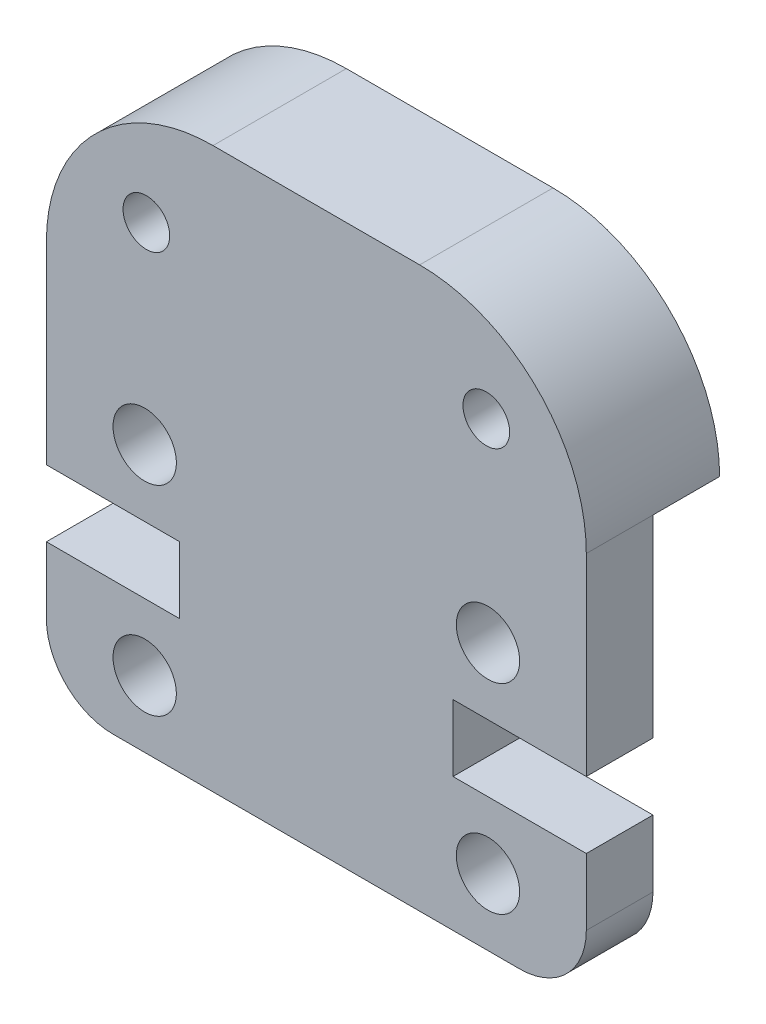
ISO-10303-21;
HEADER;
FILE_DESCRIPTION(('STEP AP214'),'2;1');
FILE_NAME('part.step','',(''),(''),'','','');
FILE_SCHEMA(('AUTOMOTIVE_DESIGN { 1 0 10303 214 1 1 1 1 }'));
ENDSEC;
DATA;
#1=APPLICATION_CONTEXT('core data for automotive mechanical design processes');
#2=APPLICATION_PROTOCOL_DEFINITION('international standard','automotive_design',2000,#1);
#3=PRODUCT_CONTEXT('',#1,'mechanical');
#4=PRODUCT('Part','Part','',(#3));
#5=PRODUCT_RELATED_PRODUCT_CATEGORY('part','',(#4));
#6=PRODUCT_DEFINITION_FORMATION('','',#4);
#7=PRODUCT_DEFINITION_CONTEXT('part definition',#1,'design');
#8=PRODUCT_DEFINITION('design','',#6,#7);
#9=PRODUCT_DEFINITION_SHAPE('','',#8);
#10=(LENGTH_UNIT() NAMED_UNIT(*) SI_UNIT(.MILLI.,.METRE.));
#11=(NAMED_UNIT(*) PLANE_ANGLE_UNIT() SI_UNIT($,.RADIAN.));
#12=(NAMED_UNIT(*) SI_UNIT($,.STERADIAN.) SOLID_ANGLE_UNIT());
#13=UNCERTAINTY_MEASURE_WITH_UNIT(LENGTH_MEASURE(1.E-05),#10,'distance_accuracy_value','');
#14=(GEOMETRIC_REPRESENTATION_CONTEXT(3) GLOBAL_UNCERTAINTY_ASSIGNED_CONTEXT((#13)) GLOBAL_UNIT_ASSIGNED_CONTEXT((#10,
#11,#12)) REPRESENTATION_CONTEXT('',''));
#15=CARTESIAN_POINT('',(0.,0.,0.));
#16=DIRECTION('',(0.,0.,1.));
#17=DIRECTION('',(1.,0.,0.));
#18=AXIS2_PLACEMENT_3D('',#15,#16,#17);
#19=CARTESIAN_POINT('',(5.,11.795,0.));
#20=DIRECTION('',(0.,0.,1.));
#21=DIRECTION('',(1.,0.,0.));
#22=AXIS2_PLACEMENT_3D('',#19,#20,#21);
#23=PLANE('',#22);
#24=CARTESIAN_POINT('',(13.1999999999957,13.7949999999999,0.));
#25=DIRECTION('',(0.,0.,1.));
#26=DIRECTION('',(-1.,0.,0.));
#27=AXIS2_PLACEMENT_3D('',#24,#25,#26);
#28=CIRCLE('',#27,0.699999999999999);
#29=CARTESIAN_POINT('',(12.4999999999957,13.7949999999999,0.));
#30=VERTEX_POINT('',#29);
#31=EDGE_CURVE('E262',#30,#30,#28,.T.);
#32=ORIENTED_EDGE('',*,*,#31,.T.);
#33=EDGE_LOOP('',(#32));
#34=FACE_BOUND('',#33,.T.);
#35=CARTESIAN_POINT('',(3.00000000000434,13.7949999999999,0.));
#36=DIRECTION('',(0.,0.,1.));
#37=DIRECTION('',(1.,0.,0.));
#38=AXIS2_PLACEMENT_3D('',#35,#36,#37);
#39=CIRCLE('',#38,0.699999999999999);
#40=CARTESIAN_POINT('',(3.70000000000434,13.7949999999999,0.));
#41=VERTEX_POINT('',#40);
#42=EDGE_CURVE('E266',#41,#41,#39,.T.);
#43=ORIENTED_EDGE('',*,*,#42,.T.);
#44=EDGE_LOOP('',(#43));
#45=FACE_BOUND('',#44,.T.);
#46=DIRECTION('',(-1.,0.,0.));
#47=VECTOR('',#46,1.);
#48=CARTESIAN_POINT('',(0.,11.795,0.));
#49=LINE('',#48,#47);
#50=CARTESIAN_POINT('',(16.2,11.795,0.));
#51=VERTEX_POINT('',#50);
#52=CARTESIAN_POINT('',(0.,11.795,0.));
#53=VERTEX_POINT('',#52);
#54=EDGE_CURVE('E220',#51,#53,#49,.T.);
#55=ORIENTED_EDGE('',*,*,#54,.T.);
#56=CARTESIAN_POINT('',(5.,11.795,0.));
#57=DIRECTION('',(0.,0.,1.));
#58=DIRECTION('',(1.,0.,0.));
#59=AXIS2_PLACEMENT_3D('',#56,#57,#58);
#60=CIRCLE('',#59,5.);
#61=CARTESIAN_POINT('',(5.,16.795,0.));
#62=VERTEX_POINT('',#61);
#63=EDGE_CURVE('E147',#62,#53,#60,.T.);
#64=ORIENTED_EDGE('',*,*,#63,.F.);
#65=DIRECTION('',(-1.,0.,0.));
#66=VECTOR('',#65,1.);
#67=CARTESIAN_POINT('',(5.,16.795,0.));
#68=LINE('',#67,#66);
#69=CARTESIAN_POINT('',(11.2,16.795,0.));
#70=VERTEX_POINT('',#69);
#71=EDGE_CURVE('E72',#70,#62,#68,.T.);
#72=ORIENTED_EDGE('',*,*,#71,.F.);
#73=CARTESIAN_POINT('',(11.2,11.795,0.));
#74=DIRECTION('',(0.,0.,1.));
#75=DIRECTION('',(-1.,0.,0.));
#76=AXIS2_PLACEMENT_3D('',#73,#74,#75);
#77=CIRCLE('',#76,5.);
#78=EDGE_CURVE('E66',#51,#70,#77,.T.);
#79=ORIENTED_EDGE('',*,*,#78,.F.);
#80=EDGE_LOOP('',(#55,#64,#72,#79));
#81=FACE_BOUND('',#80,.T.);
#82=ADVANCED_FACE('F33',(#34,#45,#81),#23,.F.);
#83=CARTESIAN_POINT('',(0.,6.00000000000001,4.));
#84=DIRECTION('',(1.,0.,0.));
#85=DIRECTION('',(0.,0.,-1.));
#86=AXIS2_PLACEMENT_3D('',#83,#84,#85);
#87=PLANE('',#86);
#88=DIRECTION('',(0.,-1.,0.));
#89=VECTOR('',#88,1.);
#90=CARTESIAN_POINT('',(0.,0.,2.));
#91=LINE('',#90,#89);
#92=CARTESIAN_POINT('',(0.,11.795,2.));
#93=VERTEX_POINT('',#92);
#94=CARTESIAN_POINT('',(0.,6.00000000000001,2.));
#95=VERTEX_POINT('',#94);
#96=EDGE_CURVE('E203',#93,#95,#91,.T.);
#97=ORIENTED_EDGE('',*,*,#96,.T.);
#98=DIRECTION('',(0.,0.,-1.));
#99=VECTOR('',#98,1.);
#100=CARTESIAN_POINT('',(0.,6.00000000000001,4.));
#101=LINE('',#100,#99);
#102=CARTESIAN_POINT('',(0.,6.00000000000001,4.));
#103=VERTEX_POINT('',#102);
#104=EDGE_CURVE('E43',#103,#95,#101,.T.);
#105=ORIENTED_EDGE('',*,*,#104,.F.);
#106=DIRECTION('',(0.,-1.,0.));
#107=VECTOR('',#106,1.);
#108=CARTESIAN_POINT('',(0.,6.00000000000001,4.));
#109=LINE('',#108,#107);
#110=CARTESIAN_POINT('',(0.,11.795,4.));
#111=VERTEX_POINT('',#110);
#112=EDGE_CURVE('E80',#111,#103,#109,.T.);
#113=ORIENTED_EDGE('',*,*,#112,.F.);
#114=DIRECTION('',(0.,0.,-1.));
#115=VECTOR('',#114,1.);
#116=CARTESIAN_POINT('',(0.,11.795,4.));
#117=LINE('',#116,#115);
#118=EDGE_CURVE('E11',#111,#93,#117,.T.);
#119=ORIENTED_EDGE('',*,*,#118,.T.);
#120=EDGE_LOOP('',(#97,#105,#113,#119));
#121=FACE_BOUND('',#120,.T.);
#122=ADVANCED_FACE('F201',(#121),#87,.F.);
#123=CARTESIAN_POINT('',(0.,6.00000000000001,4.));
#124=DIRECTION('',(0.,1.,0.));
#125=DIRECTION('',(0.,0.,1.));
#126=AXIS2_PLACEMENT_3D('',#123,#124,#125);
#127=PLANE('',#126);
#128=DIRECTION('',(-1.,0.,0.));
#129=VECTOR('',#128,1.);
#130=CARTESIAN_POINT('',(0.,6.00000000000001,2.));
#131=LINE('',#130,#129);
#132=CARTESIAN_POINT('',(4.,6.00000000000001,2.));
#133=VERTEX_POINT('',#132);
#134=EDGE_CURVE('E195',#133,#95,#131,.T.);
#135=ORIENTED_EDGE('',*,*,#134,.F.);
#136=DIRECTION('',(0.,0.,-1.));
#137=VECTOR('',#136,1.);
#138=CARTESIAN_POINT('',(4.,6.00000000000001,4.));
#139=LINE('',#138,#137);
#140=CARTESIAN_POINT('',(4.,6.00000000000001,4.));
#141=VERTEX_POINT('',#140);
#142=EDGE_CURVE('E184',#141,#133,#139,.T.);
#143=ORIENTED_EDGE('',*,*,#142,.F.);
#144=DIRECTION('',(1.,0.,0.));
#145=VECTOR('',#144,1.);
#146=CARTESIAN_POINT('',(0.,6.00000000000001,4.));
#147=LINE('',#146,#145);
#148=EDGE_CURVE('E196',#103,#141,#147,.T.);
#149=ORIENTED_EDGE('',*,*,#148,.F.);
#150=ORIENTED_EDGE('',*,*,#104,.T.);
#151=EDGE_LOOP('',(#135,#143,#149,#150));
#152=FACE_BOUND('',#151,.T.);
#153=ADVANCED_FACE('F192',(#152),#127,.F.);
#154=CARTESIAN_POINT('',(4.,6.00000000000001,4.));
#155=DIRECTION('',(1.,0.,0.));
#156=DIRECTION('',(0.,0.,-1.));
#157=AXIS2_PLACEMENT_3D('',#154,#155,#156);
#158=PLANE('',#157);
#159=DIRECTION('',(0.,1.,0.));
#160=VECTOR('',#159,1.);
#161=CARTESIAN_POINT('',(4.,6.00000000000001,2.));
#162=LINE('',#161,#160);
#163=CARTESIAN_POINT('',(4.,4.,2.));
#164=VERTEX_POINT('',#163);
#165=EDGE_CURVE('E252',#164,#133,#162,.T.);
#166=ORIENTED_EDGE('',*,*,#165,.F.);
#167=DIRECTION('',(0.,0.,-1.));
#168=VECTOR('',#167,1.);
#169=CARTESIAN_POINT('',(4.,4.,4.));
#170=LINE('',#169,#168);
#171=CARTESIAN_POINT('',(4.,4.,4.));
#172=VERTEX_POINT('',#171);
#173=EDGE_CURVE('E181',#172,#164,#170,.T.);
#174=ORIENTED_EDGE('',*,*,#173,.F.);
#175=DIRECTION('',(0.,-1.,0.));
#176=VECTOR('',#175,1.);
#177=CARTESIAN_POINT('',(4.,6.00000000000001,4.));
#178=LINE('',#177,#176);
#179=EDGE_CURVE('E282',#141,#172,#178,.T.);
#180=ORIENTED_EDGE('',*,*,#179,.F.);
#181=ORIENTED_EDGE('',*,*,#142,.T.);
#182=EDGE_LOOP('',(#166,#174,#180,#181));
#183=FACE_BOUND('',#182,.T.);
#184=ADVANCED_FACE('F328',(#183),#158,.F.);
#185=CARTESIAN_POINT('',(4.,4.,4.));
#186=DIRECTION('',(0.,-1.,0.));
#187=DIRECTION('',(0.,0.,-1.));
#188=AXIS2_PLACEMENT_3D('',#185,#186,#187);
#189=PLANE('',#188);
#190=DIRECTION('',(1.,0.,0.));
#191=VECTOR('',#190,1.);
#192=CARTESIAN_POINT('',(4.,4.,2.));
#193=LINE('',#192,#191);
#194=CARTESIAN_POINT('',(0.,4.,2.));
#195=VERTEX_POINT('',#194);
#196=EDGE_CURVE('E249',#195,#164,#193,.T.);
#197=ORIENTED_EDGE('',*,*,#196,.F.);
#198=DIRECTION('',(0.,0.,-1.));
#199=VECTOR('',#198,1.);
#200=CARTESIAN_POINT('',(0.,4.,4.));
#201=LINE('',#200,#199);
#202=CARTESIAN_POINT('',(0.,4.,4.));
#203=VERTEX_POINT('',#202);
#204=EDGE_CURVE('E178',#203,#195,#201,.T.);
#205=ORIENTED_EDGE('',*,*,#204,.F.);
#206=DIRECTION('',(-1.,0.,0.));
#207=VECTOR('',#206,1.);
#208=CARTESIAN_POINT('',(4.,4.,4.));
#209=LINE('',#208,#207);
#210=EDGE_CURVE('E284',#172,#203,#209,.T.);
#211=ORIENTED_EDGE('',*,*,#210,.F.);
#212=ORIENTED_EDGE('',*,*,#173,.T.);
#213=EDGE_LOOP('',(#197,#205,#211,#212));
#214=FACE_BOUND('',#213,.T.);
#215=ADVANCED_FACE('F332',(#214),#189,.F.);
#216=CARTESIAN_POINT('',(0.,2.,4.));
#217=DIRECTION('',(1.,0.,0.));
#218=DIRECTION('',(0.,0.,-1.));
#219=AXIS2_PLACEMENT_3D('',#216,#217,#218);
#220=PLANE('',#219);
#221=CARTESIAN_POINT('',(0.,2.,2.));
#222=VERTEX_POINT('',#221);
#223=EDGE_CURVE('E210',#195,#222,#91,.T.);
#224=ORIENTED_EDGE('',*,*,#223,.T.);
#225=DIRECTION('',(0.,0.,-1.));
#226=VECTOR('',#225,1.);
#227=CARTESIAN_POINT('',(0.,2.,4.));
#228=LINE('',#227,#226);
#229=CARTESIAN_POINT('',(0.,2.,4.));
#230=VERTEX_POINT('',#229);
#231=EDGE_CURVE('E175',#230,#222,#228,.T.);
#232=ORIENTED_EDGE('',*,*,#231,.F.);
#233=DIRECTION('',(0.,-1.,0.));
#234=VECTOR('',#233,1.);
#235=CARTESIAN_POINT('',(0.,2.,4.));
#236=LINE('',#235,#234);
#237=EDGE_CURVE('E286',#203,#230,#236,.T.);
#238=ORIENTED_EDGE('',*,*,#237,.F.);
#239=ORIENTED_EDGE('',*,*,#204,.T.);
#240=EDGE_LOOP('',(#224,#232,#238,#239));
#241=FACE_BOUND('',#240,.T.);
#242=ADVANCED_FACE('F390',(#241),#220,.F.);
#243=CARTESIAN_POINT('',(2.,2.,4.));
#244=DIRECTION('',(0.,0.,-1.));
#245=DIRECTION('',(-1.,0.,0.));
#246=AXIS2_PLACEMENT_3D('',#243,#244,#245);
#247=CYLINDRICAL_SURFACE('',#246,2.);
#248=CARTESIAN_POINT('',(2.,2.,2.));
#249=DIRECTION('',(0.,0.,-1.));
#250=DIRECTION('',(-1.,0.,0.));
#251=AXIS2_PLACEMENT_3D('',#248,#249,#250);
#252=CIRCLE('',#251,2.);
#253=CARTESIAN_POINT('',(2.,0.,2.));
#254=VERTEX_POINT('',#253);
#255=EDGE_CURVE('E246',#254,#222,#252,.T.);
#256=ORIENTED_EDGE('',*,*,#255,.F.);
#257=DIRECTION('',(0.,0.,-1.));
#258=VECTOR('',#257,1.);
#259=CARTESIAN_POINT('',(2.,0.,4.));
#260=LINE('',#259,#258);
#261=CARTESIAN_POINT('',(2.,0.,4.));
#262=VERTEX_POINT('',#261);
#263=EDGE_CURVE('E172',#262,#254,#260,.T.);
#264=ORIENTED_EDGE('',*,*,#263,.F.);
#265=CARTESIAN_POINT('',(2.,2.,4.));
#266=DIRECTION('',(0.,0.,1.));
#267=DIRECTION('',(1.,0.,0.));
#268=AXIS2_PLACEMENT_3D('',#265,#266,#267);
#269=CIRCLE('',#268,2.);
#270=EDGE_CURVE('E288',#230,#262,#269,.T.);
#271=ORIENTED_EDGE('',*,*,#270,.F.);
#272=ORIENTED_EDGE('',*,*,#231,.T.);
#273=EDGE_LOOP('',(#256,#264,#271,#272));
#274=FACE_BOUND('',#273,.T.);
#275=ADVANCED_FACE('F386',(#274),#247,.T.);
#276=CARTESIAN_POINT('',(2.,0.,4.));
#277=DIRECTION('',(0.,1.,0.));
#278=DIRECTION('',(-1.,0.,0.));
#279=AXIS2_PLACEMENT_3D('',#276,#277,#278);
#280=PLANE('',#279);
#281=DIRECTION('',(1.,0.,0.));
#282=VECTOR('',#281,1.);
#283=CARTESIAN_POINT('',(16.2,0.,2.));
#284=LINE('',#283,#282);
#285=CARTESIAN_POINT('',(14.2,0.,2.));
#286=VERTEX_POINT('',#285);
#287=EDGE_CURVE('E222',#254,#286,#284,.T.);
#288=ORIENTED_EDGE('',*,*,#287,.T.);
#289=DIRECTION('',(0.,0.,-1.));
#290=VECTOR('',#289,1.);
#291=CARTESIAN_POINT('',(14.2,0.,4.));
#292=LINE('',#291,#290);
#293=CARTESIAN_POINT('',(14.2,0.,4.));
#294=VERTEX_POINT('',#293);
#295=EDGE_CURVE('E169',#294,#286,#292,.T.);
#296=ORIENTED_EDGE('',*,*,#295,.F.);
#297=DIRECTION('',(1.,0.,0.));
#298=VECTOR('',#297,1.);
#299=CARTESIAN_POINT('',(2.,0.,4.));
#300=LINE('',#299,#298);
#301=EDGE_CURVE('E290',#262,#294,#300,.T.);
#302=ORIENTED_EDGE('',*,*,#301,.F.);
#303=ORIENTED_EDGE('',*,*,#263,.T.);
#304=EDGE_LOOP('',(#288,#296,#302,#303));
#305=FACE_BOUND('',#304,.T.);
#306=ADVANCED_FACE('F382',(#305),#280,.F.);
#307=CARTESIAN_POINT('',(14.2,2.,4.));
#308=DIRECTION('',(0.,0.,-1.));
#309=DIRECTION('',(-1.,0.,0.));
#310=AXIS2_PLACEMENT_3D('',#307,#308,#309);
#311=CYLINDRICAL_SURFACE('',#310,2.);
#312=CARTESIAN_POINT('',(14.2,2.,2.));
#313=DIRECTION('',(0.,0.,-1.));
#314=DIRECTION('',(-1.,0.,0.));
#315=AXIS2_PLACEMENT_3D('',#312,#313,#314);
#316=CIRCLE('',#315,2.);
#317=CARTESIAN_POINT('',(16.2,2.,2.));
#318=VERTEX_POINT('',#317);
#319=EDGE_CURVE('E243',#318,#286,#316,.T.);
#320=ORIENTED_EDGE('',*,*,#319,.F.);
#321=DIRECTION('',(0.,0.,-1.));
#322=VECTOR('',#321,1.);
#323=CARTESIAN_POINT('',(16.2,2.,4.));
#324=LINE('',#323,#322);
#325=CARTESIAN_POINT('',(16.2,2.,4.));
#326=VERTEX_POINT('',#325);
#327=EDGE_CURVE('E166',#326,#318,#324,.T.);
#328=ORIENTED_EDGE('',*,*,#327,.F.);
#329=CARTESIAN_POINT('',(14.2,2.,4.));
#330=DIRECTION('',(0.,0.,1.));
#331=DIRECTION('',(-1.,0.,0.));
#332=AXIS2_PLACEMENT_3D('',#329,#330,#331);
#333=CIRCLE('',#332,2.);
#334=EDGE_CURVE('E292',#294,#326,#333,.T.);
#335=ORIENTED_EDGE('',*,*,#334,.F.);
#336=ORIENTED_EDGE('',*,*,#295,.T.);
#337=EDGE_LOOP('',(#320,#328,#335,#336));
#338=FACE_BOUND('',#337,.T.);
#339=ADVANCED_FACE('F378',(#338),#311,.T.);
#340=CARTESIAN_POINT('',(16.2,2.,4.));
#341=DIRECTION('',(-1.,0.,0.));
#342=DIRECTION('',(0.,0.,1.));
#343=AXIS2_PLACEMENT_3D('',#340,#341,#342);
#344=PLANE('',#343);
#345=DIRECTION('',(0.,1.,0.));
#346=VECTOR('',#345,1.);
#347=CARTESIAN_POINT('',(16.2,11.795,2.));
#348=LINE('',#347,#346);
#349=CARTESIAN_POINT('',(16.2,4.,2.));
#350=VERTEX_POINT('',#349);
#351=EDGE_CURVE('E624',#318,#350,#348,.T.);
#352=ORIENTED_EDGE('',*,*,#351,.T.);
#353=DIRECTION('',(0.,0.,-1.));
#354=VECTOR('',#353,1.);
#355=CARTESIAN_POINT('',(16.2,4.,4.));
#356=LINE('',#355,#354);
#357=CARTESIAN_POINT('',(16.2,4.,4.));
#358=VERTEX_POINT('',#357);
#359=EDGE_CURVE('E163',#358,#350,#356,.T.);
#360=ORIENTED_EDGE('',*,*,#359,.F.);
#361=DIRECTION('',(0.,1.,0.));
#362=VECTOR('',#361,1.);
#363=CARTESIAN_POINT('',(16.2,2.,4.));
#364=LINE('',#363,#362);
#365=EDGE_CURVE('E294',#326,#358,#364,.T.);
#366=ORIENTED_EDGE('',*,*,#365,.F.);
#367=ORIENTED_EDGE('',*,*,#327,.T.);
#368=EDGE_LOOP('',(#352,#360,#366,#367));
#369=FACE_BOUND('',#368,.T.);
#370=ADVANCED_FACE('F374',(#369),#344,.F.);
#371=CARTESIAN_POINT('',(12.2,4.,4.));
#372=DIRECTION('',(0.,-1.,0.));
#373=DIRECTION('',(1.,0.,0.));
#374=AXIS2_PLACEMENT_3D('',#371,#372,#373);
#375=PLANE('',#374);
#376=DIRECTION('',(1.,0.,0.));
#377=VECTOR('',#376,1.);
#378=CARTESIAN_POINT('',(12.2,4.,2.));
#379=LINE('',#378,#377);
#380=CARTESIAN_POINT('',(12.2,4.,2.));
#381=VERTEX_POINT('',#380);
#382=EDGE_CURVE('E240',#381,#350,#379,.T.);
#383=ORIENTED_EDGE('',*,*,#382,.F.);
#384=DIRECTION('',(0.,0.,-1.));
#385=VECTOR('',#384,1.);
#386=CARTESIAN_POINT('',(12.2,4.,4.));
#387=LINE('',#386,#385);
#388=CARTESIAN_POINT('',(12.2,4.,4.));
#389=VERTEX_POINT('',#388);
#390=EDGE_CURVE('E160',#389,#381,#387,.T.);
#391=ORIENTED_EDGE('',*,*,#390,.F.);
#392=DIRECTION('',(-1.,0.,0.));
#393=VECTOR('',#392,1.);
#394=CARTESIAN_POINT('',(12.2,4.,4.));
#395=LINE('',#394,#393);
#396=EDGE_CURVE('E296',#358,#389,#395,.T.);
#397=ORIENTED_EDGE('',*,*,#396,.F.);
#398=ORIENTED_EDGE('',*,*,#359,.T.);
#399=EDGE_LOOP('',(#383,#391,#397,#398));
#400=FACE_BOUND('',#399,.T.);
#401=ADVANCED_FACE('F371',(#400),#375,.F.);
#402=CARTESIAN_POINT('',(12.2,6.,4.));
#403=DIRECTION('',(-1.,0.,0.));
#404=DIRECTION('',(0.,0.,1.));
#405=AXIS2_PLACEMENT_3D('',#402,#403,#404);
#406=PLANE('',#405);
#407=DIRECTION('',(0.,-1.,0.));
#408=VECTOR('',#407,1.);
#409=CARTESIAN_POINT('',(12.2,6.,2.));
#410=LINE('',#409,#408);
#411=CARTESIAN_POINT('',(12.2,6.,2.));
#412=VERTEX_POINT('',#411);
#413=EDGE_CURVE('E237',#412,#381,#410,.T.);
#414=ORIENTED_EDGE('',*,*,#413,.F.);
#415=DIRECTION('',(0.,0.,-1.));
#416=VECTOR('',#415,1.);
#417=CARTESIAN_POINT('',(12.2,6.,4.));
#418=LINE('',#417,#416);
#419=CARTESIAN_POINT('',(12.2,6.,4.));
#420=VERTEX_POINT('',#419);
#421=EDGE_CURVE('E157',#420,#412,#418,.T.);
#422=ORIENTED_EDGE('',*,*,#421,.F.);
#423=DIRECTION('',(0.,1.,0.));
#424=VECTOR('',#423,1.);
#425=CARTESIAN_POINT('',(12.2,6.,4.));
#426=LINE('',#425,#424);
#427=EDGE_CURVE('E298',#389,#420,#426,.T.);
#428=ORIENTED_EDGE('',*,*,#427,.F.);
#429=ORIENTED_EDGE('',*,*,#390,.T.);
#430=EDGE_LOOP('',(#414,#422,#428,#429));
#431=FACE_BOUND('',#430,.T.);
#432=ADVANCED_FACE('F305',(#431),#406,.F.);
#433=CARTESIAN_POINT('',(16.2,6.00000000000001,4.));
#434=DIRECTION('',(0.,1.,0.));
#435=DIRECTION('',(-1.,0.,0.));
#436=AXIS2_PLACEMENT_3D('',#433,#434,#435);
#437=PLANE('',#436);
#438=DIRECTION('',(-1.,0.,0.));
#439=VECTOR('',#438,1.);
#440=CARTESIAN_POINT('',(16.2,6.00000000000001,2.));
#441=LINE('',#440,#439);
#442=CARTESIAN_POINT('',(16.2,6.00000000000001,2.));
#443=VERTEX_POINT('',#442);
#444=EDGE_CURVE('E234',#443,#412,#441,.T.);
#445=ORIENTED_EDGE('',*,*,#444,.F.);
#446=DIRECTION('',(0.,0.,-1.));
#447=VECTOR('',#446,1.);
#448=CARTESIAN_POINT('',(16.2,6.00000000000001,4.));
#449=LINE('',#448,#447);
#450=CARTESIAN_POINT('',(16.2,6.00000000000001,4.));
#451=VERTEX_POINT('',#450);
#452=EDGE_CURVE('E138',#451,#443,#449,.T.);
#453=ORIENTED_EDGE('',*,*,#452,.F.);
#454=DIRECTION('',(1.,0.,0.));
#455=VECTOR('',#454,1.);
#456=CARTESIAN_POINT('',(16.2,6.00000000000001,4.));
#457=LINE('',#456,#455);
#458=EDGE_CURVE('E126',#420,#451,#457,.T.);
#459=ORIENTED_EDGE('',*,*,#458,.F.);
#460=ORIENTED_EDGE('',*,*,#421,.T.);
#461=EDGE_LOOP('',(#445,#453,#459,#460));
#462=FACE_BOUND('',#461,.T.);
#463=ADVANCED_FACE('F309',(#462),#437,.F.);
#464=CARTESIAN_POINT('',(16.2,6.00000000000001,4.));
#465=DIRECTION('',(-1.,0.,0.));
#466=DIRECTION('',(0.,-1.,0.));
#467=AXIS2_PLACEMENT_3D('',#464,#465,#466);
#468=PLANE('',#467);
#469=CARTESIAN_POINT('',(16.2,11.795,2.));
#470=VERTEX_POINT('',#469);
#471=EDGE_CURVE('E137',#443,#470,#348,.T.);
#472=ORIENTED_EDGE('',*,*,#471,.T.);
#473=DIRECTION('',(0.,0.,-1.));
#474=VECTOR('',#473,1.);
#475=CARTESIAN_POINT('',(16.2,11.795,4.));
#476=LINE('',#475,#474);
#477=CARTESIAN_POINT('',(16.2,11.795,4.));
#478=VERTEX_POINT('',#477);
#479=EDGE_CURVE('E133',#478,#470,#476,.T.);
#480=ORIENTED_EDGE('',*,*,#479,.F.);
#481=DIRECTION('',(0.,1.,0.));
#482=VECTOR('',#481,1.);
#483=CARTESIAN_POINT('',(16.2,6.00000000000001,4.));
#484=LINE('',#483,#482);
#485=EDGE_CURVE('E119',#451,#478,#484,.T.);
#486=ORIENTED_EDGE('',*,*,#485,.F.);
#487=ORIENTED_EDGE('',*,*,#452,.T.);
#488=EDGE_LOOP('',(#472,#480,#486,#487));
#489=FACE_BOUND('',#488,.T.);
#490=ADVANCED_FACE('F134',(#489),#468,.F.);
#491=CARTESIAN_POINT('',(13.25,2.,4.));
#492=DIRECTION('',(0.,0.,-1.));
#493=DIRECTION('',(-1.,0.,0.));
#494=AXIS2_PLACEMENT_3D('',#491,#492,#493);
#495=CYLINDRICAL_SURFACE('',#494,0.949999999999999);
#496=CARTESIAN_POINT('',(13.25,2.,4.));
#497=DIRECTION('',(0.,0.,1.));
#498=DIRECTION('',(-1.,0.,0.));
#499=AXIS2_PLACEMENT_3D('',#496,#497,#498);
#500=CIRCLE('',#499,0.949999999999999);
#501=CARTESIAN_POINT('',(12.3,2.,4.));
#502=VERTEX_POINT('',#501);
#503=EDGE_CURVE('E150',#502,#502,#500,.T.);
#504=ORIENTED_EDGE('',*,*,#503,.T.);
#505=EDGE_LOOP('',(#504));
#506=FACE_BOUND('',#505,.T.);
#507=CARTESIAN_POINT('',(13.25,2.,2.));
#508=DIRECTION('',(0.,0.,-1.));
#509=DIRECTION('',(-1.,0.,0.));
#510=AXIS2_PLACEMENT_3D('',#507,#508,#509);
#511=CIRCLE('',#510,0.949999999999999);
#512=CARTESIAN_POINT('',(12.3,2.,2.));
#513=VERTEX_POINT('',#512);
#514=EDGE_CURVE('E231',#513,#513,#511,.T.);
#515=ORIENTED_EDGE('',*,*,#514,.T.);
#516=EDGE_LOOP('',(#515));
#517=FACE_BOUND('',#516,.T.);
#518=ADVANCED_FACE('F366',(#506,#517),#495,.F.);
#519=CARTESIAN_POINT('',(13.25,7.99999999999954,4.));
#520=DIRECTION('',(0.,0.,-1.));
#521=DIRECTION('',(-1.,0.,0.));
#522=AXIS2_PLACEMENT_3D('',#519,#520,#521);
#523=CYLINDRICAL_SURFACE('',#522,0.949999999999999);
#524=CARTESIAN_POINT('',(13.25,7.99999999999954,4.));
#525=DIRECTION('',(0.,0.,1.));
#526=DIRECTION('',(1.,0.,0.));
#527=AXIS2_PLACEMENT_3D('',#524,#525,#526);
#528=CIRCLE('',#527,0.949999999999999);
#529=CARTESIAN_POINT('',(14.2,7.99999999999954,4.));
#530=VERTEX_POINT('',#529);
#531=EDGE_CURVE('E272',#530,#530,#528,.T.);
#532=ORIENTED_EDGE('',*,*,#531,.T.);
#533=EDGE_LOOP('',(#532));
#534=FACE_BOUND('',#533,.T.);
#535=CARTESIAN_POINT('',(13.25,7.99999999999954,2.));
#536=DIRECTION('',(0.,0.,-1.));
#537=DIRECTION('',(-1.,0.,0.));
#538=AXIS2_PLACEMENT_3D('',#535,#536,#537);
#539=CIRCLE('',#538,0.949999999999999);
#540=CARTESIAN_POINT('',(12.3,7.99999999999954,2.));
#541=VERTEX_POINT('',#540);
#542=EDGE_CURVE('E228',#541,#541,#539,.T.);
#543=ORIENTED_EDGE('',*,*,#542,.T.);
#544=EDGE_LOOP('',(#543));
#545=FACE_BOUND('',#544,.T.);
#546=ADVANCED_FACE('F454',(#534,#545),#523,.F.);
#547=CARTESIAN_POINT('',(2.95,2.,4.));
#548=DIRECTION('',(0.,0.,-1.));
#549=DIRECTION('',(-1.,0.,0.));
#550=AXIS2_PLACEMENT_3D('',#547,#548,#549);
#551=CYLINDRICAL_SURFACE('',#550,0.95);
#552=CARTESIAN_POINT('',(2.95,2.,4.));
#553=DIRECTION('',(0.,0.,1.));
#554=DIRECTION('',(1.,0.,0.));
#555=AXIS2_PLACEMENT_3D('',#552,#553,#554);
#556=CIRCLE('',#555,0.95);
#557=CARTESIAN_POINT('',(3.9,2.,4.));
#558=VERTEX_POINT('',#557);
#559=EDGE_CURVE('E259',#558,#558,#556,.T.);
#560=ORIENTED_EDGE('',*,*,#559,.T.);
#561=EDGE_LOOP('',(#560));
#562=FACE_BOUND('',#561,.T.);
#563=CARTESIAN_POINT('',(2.95,2.,2.));
#564=DIRECTION('',(0.,0.,-1.));
#565=DIRECTION('',(-1.,0.,0.));
#566=AXIS2_PLACEMENT_3D('',#563,#564,#565);
#567=CIRCLE('',#566,0.95);
#568=CARTESIAN_POINT('',(2.,2.,2.));
#569=VERTEX_POINT('',#568);
#570=EDGE_CURVE('E225',#569,#569,#567,.T.);
#571=ORIENTED_EDGE('',*,*,#570,.T.);
#572=EDGE_LOOP('',(#571));
#573=FACE_BOUND('',#572,.T.);
#574=ADVANCED_FACE('F461',(#562,#573),#551,.F.);
#575=CARTESIAN_POINT('',(2.95,7.99999999999954,4.));
#576=DIRECTION('',(0.,0.,-1.));
#577=DIRECTION('',(-1.,0.,0.));
#578=AXIS2_PLACEMENT_3D('',#575,#576,#577);
#579=CYLINDRICAL_SURFACE('',#578,0.95);
#580=CARTESIAN_POINT('',(2.95,7.99999999999954,4.));
#581=DIRECTION('',(0.,0.,1.));
#582=DIRECTION('',(-1.,0.,0.));
#583=AXIS2_PLACEMENT_3D('',#580,#581,#582);
#584=CIRCLE('',#583,0.95);
#585=CARTESIAN_POINT('',(2.,7.99999999999954,4.));
#586=VERTEX_POINT('',#585);
#587=EDGE_CURVE('E256',#586,#586,#584,.T.);
#588=ORIENTED_EDGE('',*,*,#587,.T.);
#589=EDGE_LOOP('',(#588));
#590=FACE_BOUND('',#589,.T.);
#591=CARTESIAN_POINT('',(2.95,7.99999999999954,2.));
#592=DIRECTION('',(0.,0.,-1.));
#593=DIRECTION('',(-1.,0.,0.));
#594=AXIS2_PLACEMENT_3D('',#591,#592,#593);
#595=CIRCLE('',#594,0.95);
#596=CARTESIAN_POINT('',(2.,7.99999999999954,2.));
#597=VERTEX_POINT('',#596);
#598=EDGE_CURVE('E37',#597,#597,#595,.T.);
#599=ORIENTED_EDGE('',*,*,#598,.T.);
#600=EDGE_LOOP('',(#599));
#601=FACE_BOUND('',#600,.T.);
#602=ADVANCED_FACE('F469',(#590,#601),#579,.F.);
#603=CARTESIAN_POINT('',(5.,11.795,4.));
#604=DIRECTION('',(0.,0.,1.));
#605=DIRECTION('',(1.,0.,0.));
#606=AXIS2_PLACEMENT_3D('',#603,#604,#605);
#607=PLANE('',#606);
#608=ORIENTED_EDGE('',*,*,#559,.F.);
#609=EDGE_LOOP('',(#608));
#610=FACE_BOUND('',#609,.T.);
#611=CARTESIAN_POINT('',(3.00000000000434,13.7949999999999,4.));
#612=DIRECTION('',(0.,0.,1.));
#613=DIRECTION('',(1.,0.,0.));
#614=AXIS2_PLACEMENT_3D('',#611,#612,#613);
#615=CIRCLE('',#614,0.699999999999999);
#616=CARTESIAN_POINT('',(3.70000000000434,13.7949999999999,4.));
#617=VERTEX_POINT('',#616);
#618=EDGE_CURVE('E269',#617,#617,#615,.T.);
#619=ORIENTED_EDGE('',*,*,#618,.F.);
#620=EDGE_LOOP('',(#619));
#621=FACE_BOUND('',#620,.T.);
#622=ORIENTED_EDGE('',*,*,#503,.F.);
#623=EDGE_LOOP('',(#622));
#624=FACE_BOUND('',#623,.T.);
#625=CARTESIAN_POINT('',(5.,11.795,4.));
#626=DIRECTION('',(0.,0.,1.));
#627=DIRECTION('',(1.,0.,0.));
#628=AXIS2_PLACEMENT_3D('',#625,#626,#627);
#629=CIRCLE('',#628,5.);
#630=CARTESIAN_POINT('',(5.,16.795,4.));
#631=VERTEX_POINT('',#630);
#632=EDGE_CURVE('E153',#631,#111,#629,.T.);
#633=ORIENTED_EDGE('',*,*,#632,.T.);
#634=ORIENTED_EDGE('',*,*,#112,.T.);
#635=ORIENTED_EDGE('',*,*,#148,.T.);
#636=ORIENTED_EDGE('',*,*,#179,.T.);
#637=ORIENTED_EDGE('',*,*,#210,.T.);
#638=ORIENTED_EDGE('',*,*,#237,.T.);
#639=ORIENTED_EDGE('',*,*,#270,.T.);
#640=ORIENTED_EDGE('',*,*,#301,.T.);
#641=ORIENTED_EDGE('',*,*,#334,.T.);
#642=ORIENTED_EDGE('',*,*,#365,.T.);
#643=ORIENTED_EDGE('',*,*,#396,.T.);
#644=ORIENTED_EDGE('',*,*,#427,.T.);
#645=ORIENTED_EDGE('',*,*,#458,.T.);
#646=ORIENTED_EDGE('',*,*,#485,.T.);
#647=CARTESIAN_POINT('',(11.2,11.795,4.));
#648=DIRECTION('',(0.,0.,1.));
#649=DIRECTION('',(-1.,0.,0.));
#650=AXIS2_PLACEMENT_3D('',#647,#648,#649);
#651=CIRCLE('',#650,5.);
#652=CARTESIAN_POINT('',(11.2,16.795,4.));
#653=VERTEX_POINT('',#652);
#654=EDGE_CURVE('E124',#478,#653,#651,.T.);
#655=ORIENTED_EDGE('',*,*,#654,.T.);
#656=DIRECTION('',(-1.,0.,0.));
#657=VECTOR('',#656,1.);
#658=CARTESIAN_POINT('',(5.,16.795,4.));
#659=LINE('',#658,#657);
#660=EDGE_CURVE('E51',#653,#631,#659,.T.);
#661=ORIENTED_EDGE('',*,*,#660,.T.);
#662=EDGE_LOOP('',(#633,#634,#635,#636,#637,#638,#639,#640,#641,#642,#643,#644,#645,#646,#655,#661));
#663=FACE_BOUND('',#662,.T.);
#664=ORIENTED_EDGE('',*,*,#531,.F.);
#665=EDGE_LOOP('',(#664));
#666=FACE_BOUND('',#665,.T.);
#667=CARTESIAN_POINT('',(13.1999999999957,13.7949999999999,4.));
#668=DIRECTION('',(0.,0.,1.));
#669=DIRECTION('',(-1.,0.,0.));
#670=AXIS2_PLACEMENT_3D('',#667,#668,#669);
#671=CIRCLE('',#670,0.699999999999999);
#672=CARTESIAN_POINT('',(12.4999999999957,13.7949999999999,4.));
#673=VERTEX_POINT('',#672);
#674=EDGE_CURVE('E263',#673,#673,#671,.T.);
#675=ORIENTED_EDGE('',*,*,#674,.F.);
#676=EDGE_LOOP('',(#675));
#677=FACE_BOUND('',#676,.T.);
#678=ORIENTED_EDGE('',*,*,#587,.F.);
#679=EDGE_LOOP('',(#678));
#680=FACE_BOUND('',#679,.T.);
#681=ADVANCED_FACE('F121',(#610,#621,#624,#663,#666,#677,#680),#607,.T.);
#682=CARTESIAN_POINT('',(5.,11.795,4.));
#683=DIRECTION('',(0.,0.,-1.));
#684=DIRECTION('',(-1.,0.,0.));
#685=AXIS2_PLACEMENT_3D('',#682,#683,#684);
#686=CYLINDRICAL_SURFACE('',#685,5.);
#687=ORIENTED_EDGE('',*,*,#63,.T.);
#688=DIRECTION('',(0.,0.,-1.));
#689=VECTOR('',#688,1.);
#690=CARTESIAN_POINT('',(0.,11.795,2.));
#691=LINE('',#690,#689);
#692=EDGE_CURVE('E209',#93,#53,#691,.T.);
#693=ORIENTED_EDGE('',*,*,#692,.F.);
#694=ORIENTED_EDGE('',*,*,#118,.F.);
#695=ORIENTED_EDGE('',*,*,#632,.F.);
#696=DIRECTION('',(0.,0.,-1.));
#697=VECTOR('',#696,1.);
#698=CARTESIAN_POINT('',(5.,16.795,4.));
#699=LINE('',#698,#697);
#700=EDGE_CURVE('E143',#631,#62,#699,.T.);
#701=ORIENTED_EDGE('',*,*,#700,.T.);
#702=EDGE_LOOP('',(#687,#693,#694,#695,#701));
#703=FACE_BOUND('',#702,.T.);
#704=ADVANCED_FACE('F35',(#703),#686,.T.);
#705=CARTESIAN_POINT('',(11.2,11.795,4.));
#706=DIRECTION('',(0.,0.,-1.));
#707=DIRECTION('',(-1.,0.,0.));
#708=AXIS2_PLACEMENT_3D('',#705,#706,#707);
#709=CYLINDRICAL_SURFACE('',#708,5.);
#710=ORIENTED_EDGE('',*,*,#78,.T.);
#711=DIRECTION('',(0.,0.,-1.));
#712=VECTOR('',#711,1.);
#713=CARTESIAN_POINT('',(11.2,16.795,4.));
#714=LINE('',#713,#712);
#715=EDGE_CURVE('E139',#653,#70,#714,.T.);
#716=ORIENTED_EDGE('',*,*,#715,.F.);
#717=ORIENTED_EDGE('',*,*,#654,.F.);
#718=ORIENTED_EDGE('',*,*,#479,.T.);
#719=DIRECTION('',(0.,0.,-1.));
#720=VECTOR('',#719,1.);
#721=CARTESIAN_POINT('',(16.2,11.795,2.));
#722=LINE('',#721,#720);
#723=EDGE_CURVE('E213',#470,#51,#722,.T.);
#724=ORIENTED_EDGE('',*,*,#723,.T.);
#725=EDGE_LOOP('',(#710,#716,#717,#718,#724));
#726=FACE_BOUND('',#725,.T.);
#727=ADVANCED_FACE('F141',(#726),#709,.T.);
#728=CARTESIAN_POINT('',(5.,16.795,4.));
#729=DIRECTION('',(0.,-1.,0.));
#730=DIRECTION('',(0.,0.,-1.));
#731=AXIS2_PLACEMENT_3D('',#728,#729,#730);
#732=PLANE('',#731);
#733=ORIENTED_EDGE('',*,*,#71,.T.);
#734=ORIENTED_EDGE('',*,*,#700,.F.);
#735=ORIENTED_EDGE('',*,*,#660,.F.);
#736=ORIENTED_EDGE('',*,*,#715,.T.);
#737=EDGE_LOOP('',(#733,#734,#735,#736));
#738=FACE_BOUND('',#737,.T.);
#739=ADVANCED_FACE('F358',(#738),#732,.F.);
#740=CARTESIAN_POINT('',(3.00000000000434,13.7949999999999,4.));
#741=DIRECTION('',(0.,0.,-1.));
#742=DIRECTION('',(-1.,0.,0.));
#743=AXIS2_PLACEMENT_3D('',#740,#741,#742);
#744=CYLINDRICAL_SURFACE('',#743,0.699999999999999);
#745=ORIENTED_EDGE('',*,*,#618,.T.);
#746=EDGE_LOOP('',(#745));
#747=FACE_BOUND('',#746,.T.);
#748=ORIENTED_EDGE('',*,*,#42,.F.);
#749=EDGE_LOOP('',(#748));
#750=FACE_BOUND('',#749,.T.);
#751=ADVANCED_FACE('F361',(#747,#750),#744,.F.);
#752=CARTESIAN_POINT('',(13.1999999999957,13.7949999999999,4.));
#753=DIRECTION('',(0.,0.,-1.));
#754=DIRECTION('',(-1.,0.,0.));
#755=AXIS2_PLACEMENT_3D('',#752,#753,#754);
#756=CYLINDRICAL_SURFACE('',#755,0.699999999999999);
#757=ORIENTED_EDGE('',*,*,#674,.T.);
#758=EDGE_LOOP('',(#757));
#759=FACE_BOUND('',#758,.T.);
#760=ORIENTED_EDGE('',*,*,#31,.F.);
#761=EDGE_LOOP('',(#760));
#762=FACE_BOUND('',#761,.T.);
#763=ADVANCED_FACE('F504',(#759,#762),#756,.F.);
#764=CARTESIAN_POINT('',(0.,0.,2.));
#765=DIRECTION('',(0.,0.,-1.));
#766=DIRECTION('',(-1.,0.,0.));
#767=AXIS2_PLACEMENT_3D('',#764,#765,#766);
#768=PLANE('',#767);
#769=ORIENTED_EDGE('',*,*,#514,.F.);
#770=EDGE_LOOP('',(#769));
#771=FACE_BOUND('',#770,.T.);
#772=ORIENTED_EDGE('',*,*,#542,.F.);
#773=EDGE_LOOP('',(#772));
#774=FACE_BOUND('',#773,.T.);
#775=ORIENTED_EDGE('',*,*,#570,.F.);
#776=EDGE_LOOP('',(#775));
#777=FACE_BOUND('',#776,.T.);
#778=ORIENTED_EDGE('',*,*,#598,.F.);
#779=EDGE_LOOP('',(#778));
#780=FACE_BOUND('',#779,.T.);
#781=ORIENTED_EDGE('',*,*,#134,.T.);
#782=ORIENTED_EDGE('',*,*,#96,.F.);
#783=DIRECTION('',(-1.,0.,0.));
#784=VECTOR('',#783,1.);
#785=CARTESIAN_POINT('',(0.,11.795,2.));
#786=LINE('',#785,#784);
#787=EDGE_CURVE('E216',#470,#93,#786,.T.);
#788=ORIENTED_EDGE('',*,*,#787,.F.);
#789=ORIENTED_EDGE('',*,*,#471,.F.);
#790=ORIENTED_EDGE('',*,*,#444,.T.);
#791=ORIENTED_EDGE('',*,*,#413,.T.);
#792=ORIENTED_EDGE('',*,*,#382,.T.);
#793=ORIENTED_EDGE('',*,*,#351,.F.);
#794=ORIENTED_EDGE('',*,*,#319,.T.);
#795=ORIENTED_EDGE('',*,*,#287,.F.);
#796=ORIENTED_EDGE('',*,*,#255,.T.);
#797=ORIENTED_EDGE('',*,*,#223,.F.);
#798=ORIENTED_EDGE('',*,*,#196,.T.);
#799=ORIENTED_EDGE('',*,*,#165,.T.);
#800=EDGE_LOOP('',(#781,#782,#788,#789,#790,#791,#792,#793,#794,#795,#796,#797,#798,#799));
#801=FACE_BOUND('',#800,.T.);
#802=ADVANCED_FACE('F325',(#771,#774,#777,#780,#801),#768,.T.);
#803=CARTESIAN_POINT('',(0.,11.795,2.));
#804=DIRECTION('',(0.,-1.,0.));
#805=DIRECTION('',(1.,0.,0.));
#806=AXIS2_PLACEMENT_3D('',#803,#804,#805);
#807=PLANE('',#806);
#808=ORIENTED_EDGE('',*,*,#54,.F.);
#809=ORIENTED_EDGE('',*,*,#723,.F.);
#810=ORIENTED_EDGE('',*,*,#787,.T.);
#811=ORIENTED_EDGE('',*,*,#692,.T.);
#812=EDGE_LOOP('',(#808,#809,#810,#811));
#813=FACE_BOUND('',#812,.T.);
#814=ADVANCED_FACE('F344',(#813),#807,.T.);
#815=CLOSED_SHELL('',(#82,#122,#153,#184,#215,#242,#275,#306,#339,#370,#401,#432,#463,#490,#518,
#546,#574,#602,#681,#704,#727,#739,#751,#763,#802,#814));
#816=MANIFOLD_SOLID_BREP('B2',#815);
#817=ADVANCED_BREP_SHAPE_REPRESENTATION('',(#18,#816),#14);
#818=SHAPE_DEFINITION_REPRESENTATION(#9,#817);
ENDSEC;
END-ISO-10303-21;
